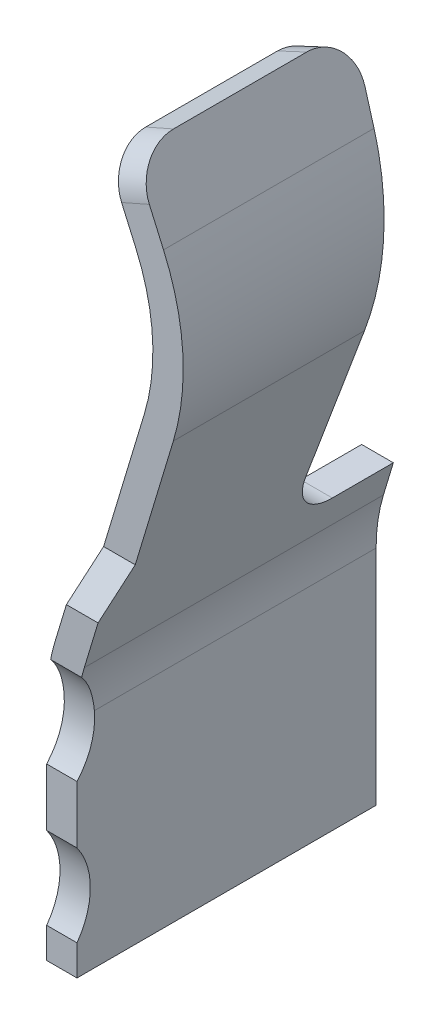
ISO-10303-21;
HEADER;
FILE_DESCRIPTION(('STEP AP214'),'2;1');
FILE_NAME('part.step','',(''),(''),'','','');
FILE_SCHEMA(('AUTOMOTIVE_DESIGN { 1 0 10303 214 1 1 1 1 }'));
ENDSEC;
DATA;
#1=APPLICATION_CONTEXT('core data for automotive mechanical design processes');
#2=APPLICATION_PROTOCOL_DEFINITION('international standard','automotive_design',2000,#1);
#3=PRODUCT_CONTEXT('',#1,'mechanical');
#4=PRODUCT('Part','Part','',(#3));
#5=PRODUCT_RELATED_PRODUCT_CATEGORY('part','',(#4));
#6=PRODUCT_DEFINITION_FORMATION('','',#4);
#7=PRODUCT_DEFINITION_CONTEXT('part definition',#1,'design');
#8=PRODUCT_DEFINITION('design','',#6,#7);
#9=PRODUCT_DEFINITION_SHAPE('','',#8);
#10=(LENGTH_UNIT() NAMED_UNIT(*) SI_UNIT(.MILLI.,.METRE.));
#11=(NAMED_UNIT(*) PLANE_ANGLE_UNIT() SI_UNIT($,.RADIAN.));
#12=(NAMED_UNIT(*) SI_UNIT($,.STERADIAN.) SOLID_ANGLE_UNIT());
#13=UNCERTAINTY_MEASURE_WITH_UNIT(LENGTH_MEASURE(1.E-05),#10,'distance_accuracy_value','');
#14=(GEOMETRIC_REPRESENTATION_CONTEXT(3) GLOBAL_UNCERTAINTY_ASSIGNED_CONTEXT((#13)) GLOBAL_UNIT_ASSIGNED_CONTEXT((#10,
#11,#12)) REPRESENTATION_CONTEXT('',''));
#15=CARTESIAN_POINT('',(0.,0.,0.));
#16=DIRECTION('',(0.,0.,1.));
#17=DIRECTION('',(1.,0.,0.));
#18=AXIS2_PLACEMENT_3D('',#15,#16,#17);
#19=CARTESIAN_POINT('',(13.38386274133,3.53312166947706,-0.236832722369338));
#20=DIRECTION('',(-0.914255270392897,-0.402239697454475,0.0483789866630426));
#21=DIRECTION('',(0.402711251685505,-0.915327071470026,0.));
#22=AXIS2_PLACEMENT_3D('',#19,#20,#21);
#23=CYLINDRICAL_SURFACE('',#22,0.2);
#24=CARTESIAN_POINT('',(13.3703585226747,3.50329761180303,-0.434687053017797));
#25=CARTESIAN_POINT('',(13.3192815955282,3.6193909515076,-0.448650066039084));
#26=CARTESIAN_POINT('',(13.2810128164818,3.70637250294574,-0.363398989614743));
#27=CARTESIAN_POINT('',(13.2810128164818,3.70637250294574,-0.235652283248446));
#28=(BOUNDED_CURVE() B_SPLINE_CURVE(3,(#24,#25,#26,#27),.UNSPECIFIED.,.F.,
.F.) B_SPLINE_CURVE_WITH_KNOTS((4,4),(3.0320715031167,4.71238898038462),
.UNSPECIFIED.) CURVE() GEOMETRIC_REPRESENTATION_ITEM() RATIONAL_B_SPLINE_CURVE((1.,
0.778229742533871,0.778229742533871,1.)) REPRESENTATION_ITEM(''));
#29=CARTESIAN_POINT('',(13.3703585226747,3.50329761180303,-0.434687053017797));
#30=VERTEX_POINT('',#29);
#31=CARTESIAN_POINT('',(13.2810128164818,3.70637250294574,-0.235652283248446));
#32=VERTEX_POINT('',#31);
#33=EDGE_CURVE('E329',#30,#32,#28,.T.);
#34=ORIENTED_EDGE('',*,*,#33,.F.);
#35=DIRECTION('',(0.914255270392898,0.402239697454473,-0.0483789866630426));
#36=VECTOR('',#35,1.);
#37=CARTESIAN_POINT('',(-10.677177596038,-7.07676024092296,0.837819069551529));
#38=LINE('',#37,#36);
#39=CARTESIAN_POINT('',(13.2330594619542,3.44289092405021,-0.427421697659669));
#40=VERTEX_POINT('',#39);
#41=EDGE_CURVE('E11',#40,#30,#38,.T.);
#42=ORIENTED_EDGE('',*,*,#41,.F.);
#43=CARTESIAN_POINT('',(13.1437137557613,3.64596581519291,-0.228386927890318));
#44=CARTESIAN_POINT('',(13.1437137557613,3.64596581519291,-0.356133634256616));
#45=CARTESIAN_POINT('',(13.1819825348076,3.55898426375477,-0.441384710680957));
#46=CARTESIAN_POINT('',(13.2330594619542,3.44289092405021,-0.427421697659669));
#47=(BOUNDED_CURVE() B_SPLINE_CURVE(3,(#43,#44,#45,#46),.UNSPECIFIED.,.F.,
.F.) B_SPLINE_CURVE_WITH_KNOTS((4,4),(1.57079632679495,3.25111380406287),
.UNSPECIFIED.) CURVE() GEOMETRIC_REPRESENTATION_ITEM() RATIONAL_B_SPLINE_CURVE((1.,
0.778229742533869,0.778229742533869,1.)) REPRESENTATION_ITEM(''));
#48=CARTESIAN_POINT('',(13.1437137557613,3.64596581519291,-0.228386927890318));
#49=VERTEX_POINT('',#48);
#50=EDGE_CURVE('E266',#49,#40,#47,.T.);
#51=ORIENTED_EDGE('',*,*,#50,.F.);
#52=DIRECTION('',(-0.914255270392898,-0.402239697454473,0.0483789866630426));
#53=VECTOR('',#52,1.);
#54=CARTESIAN_POINT('',(13.3033204909929,3.71618708377106,-0.236832722369339));
#55=LINE('',#54,#53);
#56=EDGE_CURVE('E259',#32,#49,#55,.T.);
#57=ORIENTED_EDGE('',*,*,#56,.F.);
#58=EDGE_LOOP('',(#34,#42,#51,#57));
#59=FACE_BOUND('',#58,.T.);
#60=ADVANCED_FACE('F16',(#59),#23,.T.);
#61=CARTESIAN_POINT('',(13.3615550668189,3.52330708865174,0.423604352914838));
#62=DIRECTION('',(0.915327071470026,0.402711251685505,0.));
#63=DIRECTION('',(-0.402711251685505,0.915327071470026,0.));
#64=AXIS2_PLACEMENT_3D('',#61,#62,#63);
#65=CYLINDRICAL_SURFACE('',#64,0.2);
#66=CARTESIAN_POINT('',(13.2242560060984,3.46290040089891,0.423604352914837));
#67=DIRECTION('',(-0.915327071470029,-0.402711251685498,0.));
#68=DIRECTION('',(-0.402711251685498,0.915327071470029,0.));
#69=AXIS2_PLACEMENT_3D('',#66,#67,#68);
#70=CIRCLE('',#69,0.2);
#71=CARTESIAN_POINT('',(13.2242560060984,3.46290040089891,0.623604352914837));
#72=VERTEX_POINT('',#71);
#73=CARTESIAN_POINT('',(13.1437137557613,3.64596581519291,0.423604352914837));
#74=VERTEX_POINT('',#73);
#75=EDGE_CURVE('E258',#72,#74,#70,.T.);
#76=ORIENTED_EDGE('',*,*,#75,.F.);
#77=DIRECTION('',(-0.915327071470027,-0.402711251685503,0.));
#78=VECTOR('',#77,1.);
#79=CARTESIAN_POINT('',(-11.3930633966531,-7.36784176638169,0.623604352914803));
#80=LINE('',#79,#78);
#81=CARTESIAN_POINT('',(13.3615550668189,3.52330708865174,0.623604352914837));
#82=VERTEX_POINT('',#81);
#83=EDGE_CURVE('E27',#82,#72,#80,.T.);
#84=ORIENTED_EDGE('',*,*,#83,.F.);
#85=CARTESIAN_POINT('',(13.3615550668189,3.52330708865174,0.423604352914838));
#86=DIRECTION('',(0.915327071470029,0.402711251685498,0.));
#87=DIRECTION('',(0.402711251685498,-0.915327071470029,0.));
#88=AXIS2_PLACEMENT_3D('',#85,#86,#87);
#89=CIRCLE('',#88,0.2);
#90=CARTESIAN_POINT('',(13.2810128164818,3.70637250294574,0.423604352914837));
#91=VERTEX_POINT('',#90);
#92=EDGE_CURVE('E319',#91,#82,#89,.T.);
#93=ORIENTED_EDGE('',*,*,#92,.F.);
#94=DIRECTION('',(0.915327071470027,0.402711251685503,0.));
#95=VECTOR('',#94,1.);
#96=CARTESIAN_POINT('',(13.2810128164818,3.70637250294574,0.423604352914837));
#97=LINE('',#96,#95);
#98=EDGE_CURVE('E270',#74,#91,#97,.T.);
#99=ORIENTED_EDGE('',*,*,#98,.F.);
#100=EDGE_LOOP('',(#76,#84,#93,#99));
#101=FACE_BOUND('',#100,.T.);
#102=ADVANCED_FACE('F543',(#101),#65,.T.);
#103=CARTESIAN_POINT('',(-15.49,1.65634067151207,-0.212546111318104));
#104=DIRECTION('',(0.,-1.,0.));
#105=DIRECTION('',(0.,0.,-1.));
#106=AXIS2_PLACEMENT_3D('',#103,#104,#105);
#107=PLANE('',#106);
#108=DIRECTION('',(0.,0.,-1.));
#109=VECTOR('',#108,1.);
#110=CARTESIAN_POINT('',(13.0484965908944,1.65634067151207,-0.740000000000021));
#111=LINE('',#110,#109);
#112=CARTESIAN_POINT('',(13.0484965908944,1.65634067151207,-0.438042305987955));
#113=VERTEX_POINT('',#112);
#114=CARTESIAN_POINT('',(13.0484965908944,1.65634067151207,-0.740000000000021));
#115=VERTEX_POINT('',#114);
#116=EDGE_CURVE('E401',#113,#115,#111,.T.);
#117=ORIENTED_EDGE('',*,*,#116,.F.);
#118=DIRECTION('',(1.,0.,0.));
#119=VECTOR('',#118,1.);
#120=CARTESIAN_POINT('',(13.2051649210584,1.65634067151207,-0.438042305987954));
#121=LINE('',#120,#119);
#122=CARTESIAN_POINT('',(13.2051649210585,1.65634067151207,-0.438042305987954));
#123=VERTEX_POINT('',#122);
#124=EDGE_CURVE('E359',#113,#123,#121,.T.);
#125=ORIENTED_EDGE('',*,*,#124,.T.);
#126=DIRECTION('',(0.,0.,1.));
#127=VECTOR('',#126,1.);
#128=CARTESIAN_POINT('',(13.2051649210585,1.65634067151207,-0.74000000000002));
#129=LINE('',#128,#127);
#130=CARTESIAN_POINT('',(13.2051649210585,1.65634067151207,-0.74000000000002));
#131=VERTEX_POINT('',#130);
#132=EDGE_CURVE('E436',#131,#123,#129,.T.);
#133=ORIENTED_EDGE('',*,*,#132,.F.);
#134=DIRECTION('',(-1.,0.,0.));
#135=VECTOR('',#134,1.);
#136=CARTESIAN_POINT('',(13.97,1.65634067151207,-0.740000000000019));
#137=LINE('',#136,#135);
#138=EDGE_CURVE('E320',#131,#115,#137,.T.);
#139=ORIENTED_EDGE('',*,*,#138,.T.);
#140=EDGE_LOOP('',(#117,#125,#133,#139));
#141=FACE_BOUND('',#140,.T.);
#142=ADVANCED_FACE('F546',(#141),#107,.F.);
#143=CARTESIAN_POINT('',(-15.49,3.70637250294571,-0.459111687165995));
#144=DIRECTION('',(0.,0.119413416546905,0.992844618230162));
#145=DIRECTION('',(1.,0.,0.));
#146=AXIS2_PLACEMENT_3D('',#143,#144,#145);
#147=PLANE('',#146);
#148=DIRECTION('',(0.286748539926818,0.951150986717315,-0.11439875574724));
#149=VECTOR('',#148,1.);
#150=CARTESIAN_POINT('',(13.1741223648881,1.55337185451571,-0.200161637444148));
#151=LINE('',#150,#149);
#152=CARTESIAN_POINT('',(13.2726600227304,1.88022335482146,-0.239473382341922));
#153=VERTEX_POINT('',#152);
#154=CARTESIAN_POINT('',(13.4802017604538,2.56864369924933,-0.322272466749581));
#155=VERTEX_POINT('',#154);
#156=EDGE_CURVE('E439',#153,#155,#151,.T.);
#157=ORIENTED_EDGE('',*,*,#156,.F.);
#158=DIRECTION('',(-1.,0.,0.));
#159=VECTOR('',#158,1.);
#160=CARTESIAN_POINT('',(13.0484965908944,1.88022335482146,-0.239473382341922));
#161=LINE('',#160,#159);
#162=CARTESIAN_POINT('',(13.1159916925664,1.88022335482146,-0.239473382341922));
#163=VERTEX_POINT('',#162);
#164=EDGE_CURVE('E441',#153,#163,#161,.T.);
#165=ORIENTED_EDGE('',*,*,#164,.T.);
#166=DIRECTION('',(-0.28674853992682,-0.951150986717314,0.11439875574724));
#167=VECTOR('',#166,1.);
#168=CARTESIAN_POINT('',(13.0303360451115,1.59610175610151,-0.205300934614505));
#169=LINE('',#168,#167);
#170=CARTESIAN_POINT('',(13.3365862640963,2.61194022573825,-0.327479914176623));
#171=VERTEX_POINT('',#170);
#172=EDGE_CURVE('E242',#171,#163,#169,.T.);
#173=ORIENTED_EDGE('',*,*,#172,.F.);
#174=CARTESIAN_POINT('',(13.2944766931834,3.30329498734983,-0.410631932744419));
#175=CARTESIAN_POINT('',(13.3914549897076,3.08287189317973,-0.384120760424612));
#176=CARTESIAN_POINT('',(13.4060955111766,2.84250387207174,-0.355210731501567));
#177=CARTESIAN_POINT('',(13.3365862640963,2.61194022573825,-0.327479914176623));
#178=(BOUNDED_CURVE() B_SPLINE_CURVE(3,(#174,#175,#176,#177),.UNSPECIFIED.,.F.,
.F.) B_SPLINE_CURVE_WITH_KNOTS((4,4),(4.29791199977039,5.00519872138853),
.UNSPECIFIED.) CURVE() GEOMETRIC_REPRESENTATION_ITEM() RATIONAL_B_SPLINE_CURVE((1.,
0.958744787021091,0.958744787021091,1.)) REPRESENTATION_ITEM(''));
#179=CARTESIAN_POINT('',(13.2944766931834,3.30329498734983,-0.410631932744419));
#180=VERTEX_POINT('',#179);
#181=EDGE_CURVE('E252',#180,#171,#178,.T.);
#182=ORIENTED_EDGE('',*,*,#181,.F.);
#183=DIRECTION('',(0.400292818236851,-0.909830186054405,0.109428936813833));
#184=VECTOR('',#183,1.);
#185=CARTESIAN_POINT('',(13.2800491803441,3.33608744850051,-0.414576013974334));
#186=LINE('',#185,#184);
#187=EDGE_CURVE('E250',#40,#180,#186,.T.);
#188=ORIENTED_EDGE('',*,*,#187,.F.);
#189=ORIENTED_EDGE('',*,*,#41,.T.);
#190=DIRECTION('',(-0.40029281823685,0.909830186054405,-0.109428936813833));
#191=VECTOR('',#190,1.);
#192=CARTESIAN_POINT('',(13.4176664899118,3.39577078475993,-0.421754368938235));
#193=LINE('',#192,#191);
#194=CARTESIAN_POINT('',(13.4317757539039,3.36370167510267,-0.417897288102547));
#195=VERTEX_POINT('',#194);
#196=EDGE_CURVE('E274',#195,#30,#193,.T.);
#197=ORIENTED_EDGE('',*,*,#196,.F.);
#198=CARTESIAN_POINT('',(13.4802017604538,2.56864369924933,-0.322272466749581));
#199=CARTESIAN_POINT('',(13.560137394596,2.83379189253285,-0.354162906673267));
#200=CARTESIAN_POINT('',(13.5433007949067,3.11021511680704,-0.387409439934769));
#201=CARTESIAN_POINT('',(13.4317757539039,3.36370167510267,-0.417897288102547));
#202=(BOUNDED_CURVE() B_SPLINE_CURVE(3,(#198,#199,#200,#201),.UNSPECIFIED.,.F.,
.F.) B_SPLINE_CURVE_WITH_KNOTS((4,4),(1.27798658579106,1.98527330740919),
.UNSPECIFIED.) CURVE() GEOMETRIC_REPRESENTATION_ITEM() RATIONAL_B_SPLINE_CURVE((1.,
0.958744787021091,0.958744787021091,1.)) REPRESENTATION_ITEM(''));
#203=EDGE_CURVE('E287',#155,#195,#202,.T.);
#204=ORIENTED_EDGE('',*,*,#203,.F.);
#205=EDGE_LOOP('',(#157,#165,#173,#182,#188,#189,#197,#204));
#206=FACE_BOUND('',#205,.T.);
#207=ADVANCED_FACE('F516',(#206),#147,.F.);
#208=CARTESIAN_POINT('',(-15.49,1.94413292378283,0.623604352914797));
#209=DIRECTION('',(0.,0.,-1.));
#210=DIRECTION('',(0.,-1.,0.));
#211=AXIS2_PLACEMENT_3D('',#208,#209,#210);
#212=PLANE('',#211);
#213=DIRECTION('',(0.4027112516855,-0.915327071470028,0.));
#214=VECTOR('',#213,1.);
#215=CARTESIAN_POINT('',(13.4317757539039,3.36370167510267,0.623604352914838));
#216=LINE('',#215,#214);
#217=CARTESIAN_POINT('',(13.4317757539039,3.36370167510267,0.623604352914838));
#218=VERTEX_POINT('',#217);
#219=EDGE_CURVE('E365',#82,#218,#216,.T.);
#220=ORIENTED_EDGE('',*,*,#219,.F.);
#221=ORIENTED_EDGE('',*,*,#83,.T.);
#222=DIRECTION('',(-0.402711251685501,0.915327071470028,0.));
#223=VECTOR('',#222,1.);
#224=CARTESIAN_POINT('',(13.2944766931834,3.30329498734984,0.623604352914837));
#225=LINE('',#224,#223);
#226=CARTESIAN_POINT('',(13.2944766931834,3.30329498734983,0.623604352914837));
#227=VERTEX_POINT('',#226);
#228=EDGE_CURVE('E247',#227,#72,#225,.T.);
#229=ORIENTED_EDGE('',*,*,#228,.F.);
#230=CARTESIAN_POINT('',(12.3791496217134,2.90058373566433,0.623604352914836));
#231=DIRECTION('',(0.,0.,1.));
#232=DIRECTION('',(-1.,0.,0.));
#233=AXIS2_PLACEMENT_3D('',#230,#231,#232);
#234=CIRCLE('',#233,1.);
#235=CARTESIAN_POINT('',(13.3365862640963,2.61194022573825,0.623604352914837));
#236=VERTEX_POINT('',#235);
#237=EDGE_CURVE('E230',#236,#227,#234,.T.);
#238=ORIENTED_EDGE('',*,*,#237,.F.);
#239=DIRECTION('',(0.28864350992609,0.957436642382956,0.));
#240=VECTOR('',#239,1.);
#241=CARTESIAN_POINT('',(13.012563357617,1.53714937485737,0.623604352914836));
#242=LINE('',#241,#240);
#243=CARTESIAN_POINT('',(13.1352588497716,1.94413292378283,0.623604352914837));
#244=VERTEX_POINT('',#243);
#245=EDGE_CURVE('E368',#244,#236,#242,.T.);
#246=ORIENTED_EDGE('',*,*,#245,.F.);
#247=DIRECTION('',(1.,0.,0.));
#248=VECTOR('',#247,1.);
#249=CARTESIAN_POINT('',(-15.49,1.94413292378283,0.623604352914797));
#250=LINE('',#249,#248);
#251=CARTESIAN_POINT('',(13.2919271799357,1.94413292378283,0.623604352914837));
#252=VERTEX_POINT('',#251);
#253=EDGE_CURVE('E323',#244,#252,#250,.T.);
#254=ORIENTED_EDGE('',*,*,#253,.T.);
#255=DIRECTION('',(-0.288643509926088,-0.957436642382956,0.));
#256=VECTOR('',#255,1.);
#257=CARTESIAN_POINT('',(13.1561788539745,1.49385284836845,0.623604352914837));
#258=LINE('',#257,#256);
#259=CARTESIAN_POINT('',(13.4802017604538,2.56864369924933,0.623604352914837));
#260=VERTEX_POINT('',#259);
#261=EDGE_CURVE('E341',#260,#252,#258,.T.);
#262=ORIENTED_EDGE('',*,*,#261,.F.);
#263=CARTESIAN_POINT('',(12.3791496217134,2.90058373566433,0.623604352914836));
#264=DIRECTION('',(0.,0.,-1.));
#265=DIRECTION('',(-1.,0.,0.));
#266=AXIS2_PLACEMENT_3D('',#263,#264,#265);
#267=CIRCLE('',#266,1.15);
#268=EDGE_CURVE('E286',#218,#260,#267,.T.);
#269=ORIENTED_EDGE('',*,*,#268,.F.);
#270=EDGE_LOOP('',(#220,#221,#229,#238,#246,#254,#262,#269));
#271=FACE_BOUND('',#270,.T.);
#272=ADVANCED_FACE('F255',(#271),#212,.F.);
#273=CARTESIAN_POINT('',(-15.49,1.7003498353216,0.749999999999972));
#274=DIRECTION('',(0.,-0.460287319631494,-0.887770005906065));
#275=DIRECTION('',(0.,-0.887770005906065,0.460287319631494));
#276=AXIS2_PLACEMENT_3D('',#273,#274,#275);
#277=PLANE('',#276);
#278=ORIENTED_EDGE('',*,*,#253,.F.);
#279=DIRECTION('',(0.258541028225373,0.857586072334425,-0.444637678635293));
#280=VECTOR('',#279,1.);
#281=CARTESIAN_POINT('',(13.1935765616936,2.13757401070795,0.523309818502746));
#282=LINE('',#281,#280);
#283=CARTESIAN_POINT('',(13.0675789123207,1.7196371362757,0.73999999999998));
#284=VERTEX_POINT('',#283);
#285=EDGE_CURVE('E297',#284,#244,#282,.T.);
#286=ORIENTED_EDGE('',*,*,#285,.F.);
#287=DIRECTION('',(-1.,0.,0.));
#288=VECTOR('',#287,1.);
#289=CARTESIAN_POINT('',(13.97,1.7196371362757,0.739999999999981));
#290=LINE('',#289,#288);
#291=CARTESIAN_POINT('',(13.2242472424848,1.7196371362757,0.73999999999998));
#292=VERTEX_POINT('',#291);
#293=EDGE_CURVE('E412',#292,#284,#290,.T.);
#294=ORIENTED_EDGE('',*,*,#293,.F.);
#295=DIRECTION('',(-0.258541028225372,-0.857586072334425,0.444637678635293));
#296=VECTOR('',#295,1.);
#297=CARTESIAN_POINT('',(13.3397726380838,2.10283732290249,0.541319952677682));
#298=LINE('',#297,#296);
#299=EDGE_CURVE('E345',#252,#292,#298,.T.);
#300=ORIENTED_EDGE('',*,*,#299,.F.);
#301=EDGE_LOOP('',(#278,#286,#294,#300));
#302=FACE_BOUND('',#301,.T.);
#303=ADVANCED_FACE('F491',(#302),#277,.F.);
#304=CARTESIAN_POINT('',(13.97,1.24850586493128,0.739999999999981));
#305=DIRECTION('',(0.,0.,-1.));
#306=DIRECTION('',(0.,-1.,0.));
#307=AXIS2_PLACEMENT_3D('',#304,#305,#306);
#308=PLANE('',#307);
#309=DIRECTION('',(0.,1.,0.));
#310=VECTOR('',#309,1.);
#311=CARTESIAN_POINT('',(13.12,0.145965815192914,0.73999999999998));
#312=LINE('',#311,#310);
#313=CARTESIAN_POINT('',(13.12,0.145965815192914,0.73999999999998));
#314=VERTEX_POINT('',#313);
#315=CARTESIAN_POINT('',(13.12,0.296740599868486,0.73999999999998));
#316=VERTEX_POINT('',#315);
#317=EDGE_CURVE('E358',#314,#316,#312,.T.);
#318=ORIENTED_EDGE('',*,*,#317,.T.);
#319=DIRECTION('',(-1.,0.,0.));
#320=VECTOR('',#319,1.);
#321=CARTESIAN_POINT('',(-15.49,0.296740599868486,0.73999999999994));
#322=LINE('',#321,#320);
#323=CARTESIAN_POINT('',(12.97,0.296740599868486,0.739999999999979));
#324=VERTEX_POINT('',#323);
#325=EDGE_CURVE('E304',#316,#324,#322,.T.);
#326=ORIENTED_EDGE('',*,*,#325,.T.);
#327=DIRECTION('',(0.,-1.,0.));
#328=VECTOR('',#327,1.);
#329=CARTESIAN_POINT('',(12.97,0.145965815192914,0.739999999999979));
#330=LINE('',#329,#328);
#331=CARTESIAN_POINT('',(12.97,0.145965815192914,0.739999999999979));
#332=VERTEX_POINT('',#331);
#333=EDGE_CURVE('E324',#324,#332,#330,.T.);
#334=ORIENTED_EDGE('',*,*,#333,.T.);
#335=DIRECTION('',(1.,0.,0.));
#336=VECTOR('',#335,1.);
#337=CARTESIAN_POINT('',(13.12,0.145965815192914,0.73999999999998));
#338=LINE('',#337,#336);
#339=EDGE_CURVE('E281',#332,#314,#338,.T.);
#340=ORIENTED_EDGE('',*,*,#339,.T.);
#341=EDGE_LOOP('',(#318,#326,#334,#340));
#342=FACE_BOUND('',#341,.T.);
#343=ADVANCED_FACE('F488',(#342),#308,.F.);
#344=CARTESIAN_POINT('',(13.97,1.24850586493128,-0.740000000000019));
#345=DIRECTION('',(0.,0.,-1.));
#346=DIRECTION('',(0.,-1.,0.));
#347=AXIS2_PLACEMENT_3D('',#344,#345,#346);
#348=PLANE('',#347);
#349=ORIENTED_EDGE('',*,*,#138,.F.);
#350=DIRECTION('',(0.288643509926088,0.957436642382956,0.));
#351=VECTOR('',#350,1.);
#352=CARTESIAN_POINT('',(13.1561788539745,1.49385284836845,-0.74000000000002));
#353=LINE('',#352,#351);
#354=CARTESIAN_POINT('',(13.1561788539745,1.49385284836845,-0.74000000000002));
#355=VERTEX_POINT('',#354);
#356=EDGE_CURVE('E440',#355,#131,#353,.T.);
#357=ORIENTED_EDGE('',*,*,#356,.F.);
#358=CARTESIAN_POINT('',(13.97,1.24850586493128,-0.740000000000019));
#359=DIRECTION('',(0.,0.,-1.));
#360=DIRECTION('',(1.,0.,0.));
#361=AXIS2_PLACEMENT_3D('',#358,#359,#360);
#362=CIRCLE('',#361,0.85);
#363=CARTESIAN_POINT('',(13.12,1.24850586493128,-0.74000000000002));
#364=VERTEX_POINT('',#363);
#365=EDGE_CURVE('E357',#364,#355,#362,.T.);
#366=ORIENTED_EDGE('',*,*,#365,.F.);
#367=DIRECTION('',(0.,1.,0.));
#368=VECTOR('',#367,1.);
#369=CARTESIAN_POINT('',(13.12,0.145965815192914,-0.74000000000002));
#370=LINE('',#369,#368);
#371=CARTESIAN_POINT('',(13.12,0.145965815192914,-0.74000000000002));
#372=VERTEX_POINT('',#371);
#373=EDGE_CURVE('E353',#372,#364,#370,.T.);
#374=ORIENTED_EDGE('',*,*,#373,.F.);
#375=DIRECTION('',(1.,0.,0.));
#376=VECTOR('',#375,1.);
#377=CARTESIAN_POINT('',(13.12,0.145965815192914,-0.74000000000002));
#378=LINE('',#377,#376);
#379=CARTESIAN_POINT('',(12.97,0.145965815192914,-0.740000000000021));
#380=VERTEX_POINT('',#379);
#381=EDGE_CURVE('E280',#380,#372,#378,.T.);
#382=ORIENTED_EDGE('',*,*,#381,.F.);
#383=DIRECTION('',(0.,-1.,0.));
#384=VECTOR('',#383,1.);
#385=CARTESIAN_POINT('',(12.97,0.145965815192914,-0.740000000000021));
#386=LINE('',#385,#384);
#387=CARTESIAN_POINT('',(12.97,1.24850586493128,-0.740000000000021));
#388=VERTEX_POINT('',#387);
#389=EDGE_CURVE('E42',#388,#380,#386,.T.);
#390=ORIENTED_EDGE('',*,*,#389,.F.);
#391=CARTESIAN_POINT('',(13.97,1.24850586493128,-0.740000000000019));
#392=DIRECTION('',(0.,0.,1.));
#393=DIRECTION('',(1.,0.,0.));
#394=AXIS2_PLACEMENT_3D('',#391,#392,#393);
#395=CIRCLE('',#394,1.);
#396=CARTESIAN_POINT('',(13.012563357617,1.53714937485737,-0.740000000000021));
#397=VERTEX_POINT('',#396);
#398=EDGE_CURVE('E309',#397,#388,#395,.T.);
#399=ORIENTED_EDGE('',*,*,#398,.F.);
#400=DIRECTION('',(-0.28864350992609,-0.957436642382956,0.));
#401=VECTOR('',#400,1.);
#402=CARTESIAN_POINT('',(13.012563357617,1.53714937485737,-0.740000000000021));
#403=LINE('',#402,#401);
#404=EDGE_CURVE('E298',#115,#397,#403,.T.);
#405=ORIENTED_EDGE('',*,*,#404,.F.);
#406=EDGE_LOOP('',(#349,#357,#366,#374,#382,#390,#399,#405));
#407=FACE_BOUND('',#406,.T.);
#408=ADVANCED_FACE('F18',(#407),#348,.T.);
#409=CARTESIAN_POINT('',(12.97,0.145965815192914,-0.740000000000021));
#410=DIRECTION('',(1.,0.,0.));
#411=DIRECTION('',(0.,1.,0.));
#412=AXIS2_PLACEMENT_3D('',#409,#410,#411);
#413=PLANE('',#412);
#414=DIRECTION('',(0.,-1.,0.));
#415=VECTOR('',#414,1.);
#416=CARTESIAN_POINT('',(12.97,0.145965815192914,0.739999999999979));
#417=LINE('',#416,#415);
#418=CARTESIAN_POINT('',(12.97,0.988055123608201,0.739999999999979));
#419=VERTEX_POINT('',#418);
#420=CARTESIAN_POINT('',(12.97,0.703259400131467,0.739999999999979));
#421=VERTEX_POINT('',#420);
#422=EDGE_CURVE('E291',#419,#421,#417,.T.);
#423=ORIENTED_EDGE('',*,*,#422,.F.);
#424=CARTESIAN_POINT('',(12.97,1.21669179396546,0.995153761033096));
#425=DIRECTION('',(1.,0.,0.));
#426=DIRECTION('',(0.,1.,0.));
#427=AXIS2_PLACEMENT_3D('',#424,#425,#426);
#428=CIRCLE('',#427,0.342604974863759);
#429=CARTESIAN_POINT('',(12.97,1.24850586493128,0.654029100989324));
#430=VERTEX_POINT('',#429);
#431=EDGE_CURVE('E445',#419,#430,#428,.T.);
#432=ORIENTED_EDGE('',*,*,#431,.T.);
#433=DIRECTION('',(0.,0.,1.));
#434=VECTOR('',#433,1.);
#435=CARTESIAN_POINT('',(12.97,1.24850586493128,-0.740000000000021));
#436=LINE('',#435,#434);
#437=EDGE_CURVE('E312',#388,#430,#436,.T.);
#438=ORIENTED_EDGE('',*,*,#437,.F.);
#439=ORIENTED_EDGE('',*,*,#389,.T.);
#440=DIRECTION('',(0.,0.,1.));
#441=VECTOR('',#440,1.);
#442=CARTESIAN_POINT('',(12.97,0.145965815192914,-0.740000000000021));
#443=LINE('',#442,#441);
#444=EDGE_CURVE('E276',#380,#332,#443,.T.);
#445=ORIENTED_EDGE('',*,*,#444,.T.);
#446=ORIENTED_EDGE('',*,*,#333,.F.);
#447=CARTESIAN_POINT('',(12.97,0.499999999999977,1.0194268345702));
#448=DIRECTION('',(1.,0.,0.));
#449=DIRECTION('',(0.,1.,0.));
#450=AXIS2_PLACEMENT_3D('',#447,#448,#449);
#451=CIRCLE('',#450,0.345533991988848);
#452=EDGE_CURVE('E390',#324,#421,#451,.T.);
#453=ORIENTED_EDGE('',*,*,#452,.T.);
#454=EDGE_LOOP('',(#423,#432,#438,#439,#445,#446,#453));
#455=FACE_BOUND('',#454,.T.);
#456=ADVANCED_FACE('F486',(#455),#413,.F.);
#457=CARTESIAN_POINT('',(13.97,1.24850586493128,-0.740000000000019));
#458=DIRECTION('',(0.,0.,1.));
#459=DIRECTION('',(-1.,0.,0.));
#460=AXIS2_PLACEMENT_3D('',#457,#458,#459);
#461=CYLINDRICAL_SURFACE('',#460,1.);
#462=ORIENTED_EDGE('',*,*,#437,.T.);
#463=CARTESIAN_POINT('',(12.97,1.24850586493127,0.654029100989324));
#464=CARTESIAN_POINT('',(12.9699999259264,1.25306932177748,0.654454497923835));
#465=CARTESIAN_POINT('',(12.9700312352786,1.25762446546712,0.654969794425774));
#466=CARTESIAN_POINT('',(12.9701551650957,1.26669234380872,0.656178662703507));
#467=CARTESIAN_POINT('',(12.970247549203,1.27120517419842,0.656871540938563));
#468=CARTESIAN_POINT('',(12.9704919132932,1.28018764830056,0.658435530000101));
#469=CARTESIAN_POINT('',(12.9706437571039,1.28465736694881,0.659306231418194));
#470=CARTESIAN_POINT('',(12.971005222969,1.29355289226453,0.661225514697385));
#471=CARTESIAN_POINT('',(12.9712148055409,1.29797872680563,0.66227397481712));
#472=CARTESIAN_POINT('',(12.9716899720729,1.30678583476397,0.664548502475786));
#473=CARTESIAN_POINT('',(12.971955607474,1.31116706334694,0.665774732832754));
#474=CARTESIAN_POINT('',(12.9725411084712,1.31988437499395,0.668404514864849));
#475=CARTESIAN_POINT('',(12.9728611090054,1.32422031651338,0.669808505488944));
#476=CARTESIAN_POINT('',(12.9735535893038,1.33284654509273,0.672793524574298));
#477=CARTESIAN_POINT('',(12.9739262786269,1.33713657245114,0.67437525453736));
#478=CARTESIAN_POINT('',(12.9747223975815,1.34567049059148,0.677715533217567));
#479=CARTESIAN_POINT('',(12.975146101327,1.34991398511754,0.679475028174295));
#480=CARTESIAN_POINT('',(12.9760367815061,1.35830019523904,0.683146652073494));
#481=CARTESIAN_POINT('',(12.9765034928044,1.36244335249443,0.685057836907499));
#482=CARTESIAN_POINT('',(12.977476871398,1.37063194178074,0.6890335315101));
#483=CARTESIAN_POINT('',(12.9779833878834,1.3746776733665,0.691097460992356));
#484=CARTESIAN_POINT('',(12.9790328683176,1.38267128376232,0.695378434355305));
#485=CARTESIAN_POINT('',(12.9795757526474,1.3866193519919,0.69759514404689));
#486=CARTESIAN_POINT('',(12.9806945570178,1.39441764648526,0.702181418874191));
#487=CARTESIAN_POINT('',(12.9812704570056,1.39826793013232,0.704550891332612));
#488=CARTESIAN_POINT('',(12.982451970372,1.40587073759695,0.709442454924467));
#489=CARTESIAN_POINT('',(12.9830576108172,1.40962316741917,0.711964685588729));
#490=CARTESIAN_POINT('',(12.9842953792636,1.4170304504751,0.717161525963165));
#491=CARTESIAN_POINT('',(12.984927568527,1.42068504210779,0.719836493879691));
#492=CARTESIAN_POINT('',(12.9862152934578,1.42789683764576,0.725338623347788));
#493=CARTESIAN_POINT('',(12.9868709115292,1.43145359950846,0.728166344681211));
#494=CARTESIAN_POINT('',(12.9882024840542,1.43847023752972,0.733973670299352));
#495=CARTESIAN_POINT('',(12.988878529499,1.44192948379825,0.736954014976151));
#496=CARTESIAN_POINT('',(12.9895608818653,1.44532846432271,0.73999999999998));
#497=B_SPLINE_CURVE_WITH_KNOTS('',3,(#463,#464,#465,#466,#467,#468,#469,#470,#471,#472,#473,
#474,#475,#476,#477,#478,#479,#480,#481,#482,#483,#484,#485,#486,#487,#488,#489,#490,#491,#492,
#493,#494,#495,#496),.UNSPECIFIED.,.F.,.F.,(4,2,2,2,2,2,2,2,2,2,2,2,2,2,2,2,4),(0.,
0.013748827736232,0.0274447569667543,0.0411095020469267,0.0547649260984996,0.0684329369744623,
0.0821353821572885,0.0958939450956066,0.109730045405059,0.123485924962941,0.137191991355335,
0.150868974599205,0.164537737053089,0.17821917870054,0.191934141578145,0.205703315519925,
0.219547147320743),.UNSPECIFIED.);
#498=CARTESIAN_POINT('',(12.9895608818653,1.44532846432271,0.739999999999979));
#499=VERTEX_POINT('',#498);
#500=EDGE_CURVE('E394',#430,#499,#497,.T.);
#501=ORIENTED_EDGE('',*,*,#500,.T.);
#502=CARTESIAN_POINT('',(13.97,1.24850586493128,0.739999999999981));
#503=DIRECTION('',(0.,0.,1.));
#504=DIRECTION('',(1.,0.,0.));
#505=AXIS2_PLACEMENT_3D('',#502,#503,#504);
#506=CIRCLE('',#505,1.);
#507=CARTESIAN_POINT('',(13.012563357617,1.53714937485737,0.739999999999979));
#508=VERTEX_POINT('',#507);
#509=EDGE_CURVE('E583',#508,#499,#506,.T.);
#510=ORIENTED_EDGE('',*,*,#509,.F.);
#511=DIRECTION('',(0.,0.,1.));
#512=VECTOR('',#511,1.);
#513=CARTESIAN_POINT('',(13.012563357617,1.53714937485737,-0.740000000000021));
#514=LINE('',#513,#512);
#515=EDGE_CURVE('E294',#397,#508,#514,.T.);
#516=ORIENTED_EDGE('',*,*,#515,.F.);
#517=ORIENTED_EDGE('',*,*,#398,.T.);
#518=EDGE_LOOP('',(#462,#501,#510,#516,#517));
#519=FACE_BOUND('',#518,.T.);
#520=ADVANCED_FACE('F475',(#519),#461,.T.);
#521=CARTESIAN_POINT('',(13.012563357617,1.53714937485737,-0.740000000000021));
#522=DIRECTION('',(0.957436642382956,-0.28864350992609,0.));
#523=DIRECTION('',(0.,0.,-1.));
#524=AXIS2_PLACEMENT_3D('',#521,#522,#523);
#525=PLANE('',#524);
#526=ORIENTED_EDGE('',*,*,#172,.T.);
#527=CARTESIAN_POINT('',(13.1159916925664,1.88022335482146,-0.239473382341922));
#528=CARTESIAN_POINT('',(13.1136017257014,1.87229578405696,-0.238519901512672));
#529=CARTESIAN_POINT('',(13.1111988444155,1.86432537588468,-0.238042305987954));
#530=CARTESIAN_POINT('',(13.1087916531782,1.85634067151208,-0.238042305987954));
#531=(BOUNDED_CURVE() B_SPLINE_CURVE(3,(#527,#528,#529,#530),.UNSPECIFIED.,.F.,
.F.) B_SPLINE_CURVE_WITH_KNOTS((4,4),(4.59268992994791,4.71238898038469),
.UNSPECIFIED.) CURVE() GEOMETRIC_REPRESENTATION_ITEM() RATIONAL_B_SPLINE_CURVE((1.,
0.998806367803328,0.998806367803328,1.)) REPRESENTATION_ITEM(''));
#532=CARTESIAN_POINT('',(13.1087916531782,1.85634067151208,-0.238042305987954));
#533=VERTEX_POINT('',#532);
#534=EDGE_CURVE('E446',#163,#533,#531,.T.);
#535=ORIENTED_EDGE('',*,*,#534,.T.);
#536=CARTESIAN_POINT('',(13.1087916531782,1.85634067151208,-0.238042305987954));
#537=CARTESIAN_POINT('',(13.0734716234365,1.73918338398669,-0.238042305987954));
#538=CARTESIAN_POINT('',(13.0484965908944,1.65634067151208,-0.320885018462573));
#539=CARTESIAN_POINT('',(13.0484965908944,1.65634067151207,-0.438042305987955));
#540=(BOUNDED_CURVE() B_SPLINE_CURVE(3,(#536,#537,#538,#539),.UNSPECIFIED.,.F.,
.F.) B_SPLINE_CURVE_WITH_KNOTS((4,4),(4.71238898038469,6.28318530717959),
.UNSPECIFIED.) CURVE() GEOMETRIC_REPRESENTATION_ITEM() RATIONAL_B_SPLINE_CURVE((1.,
0.804737854124365,0.804737854124365,1.)) REPRESENTATION_ITEM(''));
#541=EDGE_CURVE('E363',#533,#113,#540,.T.);
#542=ORIENTED_EDGE('',*,*,#541,.T.);
#543=ORIENTED_EDGE('',*,*,#116,.T.);
#544=ORIENTED_EDGE('',*,*,#404,.T.);
#545=ORIENTED_EDGE('',*,*,#515,.T.);
#546=DIRECTION('',(-0.28864350992609,-0.957436642382956,0.));
#547=VECTOR('',#546,1.);
#548=CARTESIAN_POINT('',(13.012563357617,1.53714937485737,0.739999999999979));
#549=LINE('',#548,#547);
#550=EDGE_CURVE('E419',#284,#508,#549,.T.);
#551=ORIENTED_EDGE('',*,*,#550,.F.);
#552=ORIENTED_EDGE('',*,*,#285,.T.);
#553=ORIENTED_EDGE('',*,*,#245,.T.);
#554=DIRECTION('',(0.,0.,1.));
#555=VECTOR('',#554,1.);
#556=CARTESIAN_POINT('',(13.3365862640963,2.61194022573825,-0.74000000000002));
#557=LINE('',#556,#555);
#558=EDGE_CURVE('E237',#171,#236,#557,.T.);
#559=ORIENTED_EDGE('',*,*,#558,.F.);
#560=EDGE_LOOP('',(#526,#535,#542,#543,#544,#545,#551,#552,#553,#559));
#561=FACE_BOUND('',#560,.T.);
#562=ADVANCED_FACE('F485',(#561),#525,.F.);
#563=CARTESIAN_POINT('',(12.3791496217134,2.90058373566433,-0.740000000000021));
#564=DIRECTION('',(0.,0.,1.));
#565=DIRECTION('',(-1.,0.,0.));
#566=AXIS2_PLACEMENT_3D('',#563,#564,#565);
#567=CYLINDRICAL_SURFACE('',#566,1.);
#568=DIRECTION('',(0.,0.,1.));
#569=VECTOR('',#568,1.);
#570=CARTESIAN_POINT('',(13.2944766931834,3.30329498734983,-0.74000000000002));
#571=LINE('',#570,#569);
#572=EDGE_CURVE('E234',#180,#227,#571,.T.);
#573=ORIENTED_EDGE('',*,*,#572,.F.);
#574=ORIENTED_EDGE('',*,*,#181,.T.);
#575=ORIENTED_EDGE('',*,*,#558,.T.);
#576=ORIENTED_EDGE('',*,*,#237,.T.);
#577=EDGE_LOOP('',(#573,#574,#575,#576));
#578=FACE_BOUND('',#577,.T.);
#579=ADVANCED_FACE('F232',(#578),#567,.F.);
#580=CARTESIAN_POINT('',(13.2944766931834,3.30329498734984,-0.74000000000002));
#581=DIRECTION('',(0.915327071470028,0.402711251685501,0.));
#582=DIRECTION('',(0.,0.,-1.));
#583=AXIS2_PLACEMENT_3D('',#580,#581,#582);
#584=PLANE('',#583);
#585=ORIENTED_EDGE('',*,*,#228,.T.);
#586=ORIENTED_EDGE('',*,*,#75,.T.);
#587=DIRECTION('',(0.,0.,1.));
#588=VECTOR('',#587,1.);
#589=CARTESIAN_POINT('',(13.1437137557613,3.64596581519291,-0.740000000000021));
#590=LINE('',#589,#588);
#591=EDGE_CURVE('E335',#49,#74,#590,.T.);
#592=ORIENTED_EDGE('',*,*,#591,.F.);
#593=ORIENTED_EDGE('',*,*,#50,.T.);
#594=ORIENTED_EDGE('',*,*,#187,.T.);
#595=ORIENTED_EDGE('',*,*,#572,.T.);
#596=EDGE_LOOP('',(#585,#586,#592,#593,#594,#595));
#597=FACE_BOUND('',#596,.T.);
#598=ADVANCED_FACE('F246',(#597),#584,.F.);
#599=CARTESIAN_POINT('',(13.2810128164818,3.70637250294574,-0.74000000000002));
#600=DIRECTION('',(0.402711251685503,-0.915327071470027,0.));
#601=DIRECTION('',(0.,0.,-1.));
#602=AXIS2_PLACEMENT_3D('',#599,#600,#601);
#603=PLANE('',#602);
#604=ORIENTED_EDGE('',*,*,#591,.T.);
#605=ORIENTED_EDGE('',*,*,#98,.T.);
#606=DIRECTION('',(0.,0.,1.));
#607=VECTOR('',#606,1.);
#608=CARTESIAN_POINT('',(13.2810128164818,3.70637250294574,-0.74000000000002));
#609=LINE('',#608,#607);
#610=EDGE_CURVE('E315',#32,#91,#609,.T.);
#611=ORIENTED_EDGE('',*,*,#610,.F.);
#612=ORIENTED_EDGE('',*,*,#56,.T.);
#613=EDGE_LOOP('',(#604,#605,#611,#612));
#614=FACE_BOUND('',#613,.T.);
#615=ADVANCED_FACE('F525',(#614),#603,.F.);
#616=CARTESIAN_POINT('',(13.4317757539039,3.36370167510267,-0.74000000000002));
#617=DIRECTION('',(-0.915327071470028,-0.4027112516855,0.));
#618=DIRECTION('',(-0.4027112516855,0.915327071470028,0.));
#619=AXIS2_PLACEMENT_3D('',#616,#617,#618);
#620=PLANE('',#619);
#621=ORIENTED_EDGE('',*,*,#610,.T.);
#622=ORIENTED_EDGE('',*,*,#92,.T.);
#623=ORIENTED_EDGE('',*,*,#219,.T.);
#624=DIRECTION('',(0.,0.,1.));
#625=VECTOR('',#624,1.);
#626=CARTESIAN_POINT('',(13.4317757539039,3.36370167510267,-0.74000000000002));
#627=LINE('',#626,#625);
#628=EDGE_CURVE('E282',#195,#218,#627,.T.);
#629=ORIENTED_EDGE('',*,*,#628,.F.);
#630=ORIENTED_EDGE('',*,*,#196,.T.);
#631=ORIENTED_EDGE('',*,*,#33,.T.);
#632=EDGE_LOOP('',(#621,#622,#623,#629,#630,#631));
#633=FACE_BOUND('',#632,.T.);
#634=ADVANCED_FACE('F497',(#633),#620,.F.);
#635=CARTESIAN_POINT('',(12.3791496217134,2.90058373566433,-0.740000000000021));
#636=DIRECTION('',(0.,0.,1.));
#637=DIRECTION('',(-1.,0.,0.));
#638=AXIS2_PLACEMENT_3D('',#635,#636,#637);
#639=CYLINDRICAL_SURFACE('',#638,1.15);
#640=DIRECTION('',(0.,0.,1.));
#641=VECTOR('',#640,1.);
#642=CARTESIAN_POINT('',(13.4802017604538,2.56864369924933,-0.74000000000002));
#643=LINE('',#642,#641);
#644=EDGE_CURVE('E346',#155,#260,#643,.T.);
#645=ORIENTED_EDGE('',*,*,#644,.F.);
#646=ORIENTED_EDGE('',*,*,#203,.T.);
#647=ORIENTED_EDGE('',*,*,#628,.T.);
#648=ORIENTED_EDGE('',*,*,#268,.T.);
#649=EDGE_LOOP('',(#645,#646,#647,#648));
#650=FACE_BOUND('',#649,.T.);
#651=ADVANCED_FACE('F493',(#650),#639,.T.);
#652=CARTESIAN_POINT('',(13.1561788539745,1.49385284836845,-0.74000000000002));
#653=DIRECTION('',(-0.957436642382956,0.288643509926088,0.));
#654=DIRECTION('',(0.,0.,1.));
#655=AXIS2_PLACEMENT_3D('',#652,#653,#654);
#656=PLANE('',#655);
#657=ORIENTED_EDGE('',*,*,#356,.T.);
#658=ORIENTED_EDGE('',*,*,#132,.T.);
#659=CARTESIAN_POINT('',(13.2051649210585,1.65634067151207,-0.438042305987954));
#660=CARTESIAN_POINT('',(13.2051649210585,1.65634067151208,-0.320885018462573));
#661=CARTESIAN_POINT('',(13.2301399536005,1.73918338398669,-0.238042305987954));
#662=CARTESIAN_POINT('',(13.2654599833422,1.85634067151208,-0.238042305987954));
#663=(BOUNDED_CURVE() B_SPLINE_CURVE(3,(#659,#660,#661,#662),.UNSPECIFIED.,.F.,
.F.) B_SPLINE_CURVE_WITH_KNOTS((4,4),(0.,1.5707963267949),
.UNSPECIFIED.) CURVE() GEOMETRIC_REPRESENTATION_ITEM() RATIONAL_B_SPLINE_CURVE((1.,
0.804737854124365,0.804737854124365,1.)) REPRESENTATION_ITEM(''));
#664=CARTESIAN_POINT('',(13.2654599833422,1.85634067151208,-0.238042305987954));
#665=VERTEX_POINT('',#664);
#666=EDGE_CURVE('E364',#123,#665,#663,.T.);
#667=ORIENTED_EDGE('',*,*,#666,.T.);
#668=CARTESIAN_POINT('',(13.2654599833422,1.85634067151208,-0.238042305987954));
#669=CARTESIAN_POINT('',(13.2678671745795,1.86432537588468,-0.238042305987954));
#670=CARTESIAN_POINT('',(13.2702700558654,1.87229578405696,-0.238519901512672));
#671=CARTESIAN_POINT('',(13.2726600227304,1.88022335482146,-0.239473382341922));
#672=(BOUNDED_CURVE() B_SPLINE_CURVE(3,(#668,#669,#670,#671),.UNSPECIFIED.,.F.,
.F.) B_SPLINE_CURVE_WITH_KNOTS((4,4),(1.5707963267949,1.69049537723168),
.UNSPECIFIED.) CURVE() GEOMETRIC_REPRESENTATION_ITEM() RATIONAL_B_SPLINE_CURVE((1.,
0.998806367803328,0.998806367803328,1.)) REPRESENTATION_ITEM(''));
#673=EDGE_CURVE('E395',#665,#153,#672,.T.);
#674=ORIENTED_EDGE('',*,*,#673,.T.);
#675=ORIENTED_EDGE('',*,*,#156,.T.);
#676=ORIENTED_EDGE('',*,*,#644,.T.);
#677=ORIENTED_EDGE('',*,*,#261,.T.);
#678=ORIENTED_EDGE('',*,*,#299,.T.);
#679=DIRECTION('',(0.288643509926088,0.957436642382956,0.));
#680=VECTOR('',#679,1.);
#681=CARTESIAN_POINT('',(13.1561788539745,1.49385284836845,0.73999999999998));
#682=LINE('',#681,#680);
#683=CARTESIAN_POINT('',(13.1561788539745,1.49385284836845,0.73999999999998));
#684=VERTEX_POINT('',#683);
#685=EDGE_CURVE('E420',#684,#292,#682,.T.);
#686=ORIENTED_EDGE('',*,*,#685,.F.);
#687=DIRECTION('',(0.,0.,1.));
#688=VECTOR('',#687,1.);
#689=CARTESIAN_POINT('',(13.1561788539745,1.49385284836845,-0.74000000000002));
#690=LINE('',#689,#688);
#691=EDGE_CURVE('E423',#355,#684,#690,.T.);
#692=ORIENTED_EDGE('',*,*,#691,.F.);
#693=EDGE_LOOP('',(#657,#658,#667,#674,#675,#676,#677,#678,#686,#692));
#694=FACE_BOUND('',#693,.T.);
#695=ADVANCED_FACE('F496',(#694),#656,.F.);
#696=CARTESIAN_POINT('',(13.97,1.24850586493128,-0.740000000000019));
#697=DIRECTION('',(0.,0.,1.));
#698=DIRECTION('',(-1.,0.,0.));
#699=AXIS2_PLACEMENT_3D('',#696,#697,#698);
#700=CYLINDRICAL_SURFACE('',#699,0.85);
#701=CARTESIAN_POINT('',(13.97,1.24850586493128,0.739999999999981));
#702=DIRECTION('',(0.,0.,-1.));
#703=DIRECTION('',(1.,0.,0.));
#704=AXIS2_PLACEMENT_3D('',#701,#702,#703);
#705=CIRCLE('',#704,0.85);
#706=CARTESIAN_POINT('',(13.1431016601971,1.44532846432271,0.73999999999998));
#707=VERTEX_POINT('',#706);
#708=EDGE_CURVE('E328',#707,#684,#705,.T.);
#709=ORIENTED_EDGE('',*,*,#708,.F.);
#710=CARTESIAN_POINT('',(13.1431016601971,1.44532846432271,0.73999999999998));
#711=CARTESIAN_POINT('',(13.1422937359608,1.44193422770695,0.736958271493098));
#712=CARTESIAN_POINT('',(13.1414935308879,1.43847955797059,0.733981716742319));
#713=CARTESIAN_POINT('',(13.1399179745642,1.43147212175971,0.728181521053011));
#714=CARTESIAN_POINT('',(13.139142509545,1.42792001022663,0.725357119538411));
#715=CARTESIAN_POINT('',(13.137619898276,1.4207175323937,0.719861180213829));
#716=CARTESIAN_POINT('',(13.1368726475581,1.41706763678396,0.71718905488421));
#717=CARTESIAN_POINT('',(13.1354100533638,1.40966975247532,0.711997459324748));
#718=CARTESIAN_POINT('',(13.1346946289265,1.40592205633012,0.70947759512215));
#719=CARTESIAN_POINT('',(13.1332993425092,1.39832873431199,0.704590332990138));
#720=CARTESIAN_POINT('',(13.1326194379124,1.39448323442784,0.702222751523349));
#721=CARTESIAN_POINT('',(13.1312989275512,1.38669456373035,0.697639830714333));
#722=CARTESIAN_POINT('',(13.130658332248,1.38275136730644,0.695424531879018));
#723=CARTESIAN_POINT('',(13.1294202487445,1.37476761007239,0.691145978302787));
#724=CARTESIAN_POINT('',(13.1288228383314,1.37072689023599,0.689082997790646));
#725=CARTESIAN_POINT('',(13.1276750208946,1.36254855284234,0.685108739352284));
#726=CARTESIAN_POINT('',(13.1271247723653,1.35841066384869,0.683197974378515));
#727=CARTESIAN_POINT('',(13.1260735612992,1.35002514120476,0.679522568881539));
#728=CARTESIAN_POINT('',(13.1255730181972,1.34577690210598,0.677759189022487));
#729=CARTESIAN_POINT('',(13.1246327010762,1.33723291777967,0.674411725036891));
#730=CARTESIAN_POINT('',(13.1241925856845,1.33293760118074,0.672826643700267));
#731=CARTESIAN_POINT('',(13.1233749886142,1.32430048357208,0.669835440034503));
#732=CARTESIAN_POINT('',(13.1229972403523,1.31995896955667,0.668428562333123));
#733=CARTESIAN_POINT('',(13.1223062239364,1.31123044848471,0.665793545957981));
#734=CARTESIAN_POINT('',(13.1219927759782,1.3068436053387,0.664564911759195));
#735=CARTESIAN_POINT('',(13.1214322058704,1.29802547391543,0.662286113687467));
#736=CARTESIAN_POINT('',(13.1211850012893,1.29359424806089,0.661235728608814));
#737=CARTESIAN_POINT('',(13.1207587472366,1.28468842884806,0.65931313537944));
#738=CARTESIAN_POINT('',(13.1205797216278,1.28021382086674,0.658440989662554));
#739=CARTESIAN_POINT('',(13.1202916840783,1.27122235283852,0.656874652664155));
#740=CARTESIAN_POINT('',(13.1201828092591,1.26670542744488,0.656180811490092));
#741=CARTESIAN_POINT('',(13.1200367958811,1.25763046365139,0.654970556104551));
#742=CARTESIAN_POINT('',(13.1199999120407,1.25307233639069,0.654454777190054));
#743=CARTESIAN_POINT('',(13.12,1.24850586493127,0.654029100989324));
#744=B_SPLINE_CURVE_WITH_KNOTS('',3,(#710,#711,#712,#713,#714,#715,#716,#717,#718,#719,#720,
#721,#722,#723,#724,#725,#726,#727,#728,#729,#730,#731,#732,#733,#734,#735,#736,#737,#738,#739,
#740,#741,#742,#743),.UNSPECIFIED.,.F.,.F.,(4,2,2,2,2,2,2,2,2,2,2,2,2,2,2,2,4),(0.,
0.0138857173785059,0.0276939528951882,0.0414446944234779,0.0551581812157601,0.0688548176549652,
0.0825550833892895,0.0962794417966584,0.110048248811198,0.123924815747354,0.137719445398476,
0.151453492382398,0.165148594715206,0.178826575238555,0.192509338715511,0.206218766980375,
0.219976614634782),.UNSPECIFIED.);
#745=CARTESIAN_POINT('',(13.12,1.24850586493128,0.654029100989325));
#746=VERTEX_POINT('',#745);
#747=EDGE_CURVE('E592',#707,#746,#744,.T.);
#748=ORIENTED_EDGE('',*,*,#747,.T.);
#749=DIRECTION('',(0.,0.,1.));
#750=VECTOR('',#749,1.);
#751=CARTESIAN_POINT('',(13.12,1.24850586493128,-0.74000000000002));
#752=LINE('',#751,#750);
#753=EDGE_CURVE('E352',#364,#746,#752,.T.);
#754=ORIENTED_EDGE('',*,*,#753,.F.);
#755=ORIENTED_EDGE('',*,*,#365,.T.);
#756=ORIENTED_EDGE('',*,*,#691,.T.);
#757=EDGE_LOOP('',(#709,#748,#754,#755,#756));
#758=FACE_BOUND('',#757,.T.);
#759=ADVANCED_FACE('F503',(#758),#700,.F.);
#760=CARTESIAN_POINT('',(13.12,0.145965815192914,-0.74000000000002));
#761=DIRECTION('',(-1.,0.,0.));
#762=DIRECTION('',(0.,0.,1.));
#763=AXIS2_PLACEMENT_3D('',#760,#761,#762);
#764=PLANE('',#763);
#765=ORIENTED_EDGE('',*,*,#753,.T.);
#766=CARTESIAN_POINT('',(13.12,1.21669179396546,0.995153761033097));
#767=DIRECTION('',(-1.,0.,0.));
#768=DIRECTION('',(0.,0.,1.));
#769=AXIS2_PLACEMENT_3D('',#766,#767,#768);
#770=CIRCLE('',#769,0.342604974863759);
#771=CARTESIAN_POINT('',(13.12,0.988055123608201,0.73999999999998));
#772=VERTEX_POINT('',#771);
#773=EDGE_CURVE('E589',#746,#772,#770,.T.);
#774=ORIENTED_EDGE('',*,*,#773,.T.);
#775=DIRECTION('',(0.,1.,0.));
#776=VECTOR('',#775,1.);
#777=CARTESIAN_POINT('',(13.12,0.145965815192914,0.73999999999998));
#778=LINE('',#777,#776);
#779=CARTESIAN_POINT('',(13.12,0.703259400131467,0.73999999999998));
#780=VERTEX_POINT('',#779);
#781=EDGE_CURVE('E325',#780,#772,#778,.T.);
#782=ORIENTED_EDGE('',*,*,#781,.F.);
#783=CARTESIAN_POINT('',(13.12,0.499999999999977,1.0194268345702));
#784=DIRECTION('',(-1.,0.,0.));
#785=DIRECTION('',(0.,0.,1.));
#786=AXIS2_PLACEMENT_3D('',#783,#784,#785);
#787=CIRCLE('',#786,0.345533991988848);
#788=EDGE_CURVE('E299',#780,#316,#787,.T.);
#789=ORIENTED_EDGE('',*,*,#788,.T.);
#790=ORIENTED_EDGE('',*,*,#317,.F.);
#791=DIRECTION('',(0.,0.,1.));
#792=VECTOR('',#791,1.);
#793=CARTESIAN_POINT('',(13.12,0.145965815192914,-0.74000000000002));
#794=LINE('',#793,#792);
#795=EDGE_CURVE('E308',#372,#314,#794,.T.);
#796=ORIENTED_EDGE('',*,*,#795,.F.);
#797=ORIENTED_EDGE('',*,*,#373,.T.);
#798=EDGE_LOOP('',(#765,#774,#782,#789,#790,#796,#797));
#799=FACE_BOUND('',#798,.T.);
#800=ADVANCED_FACE('F499',(#799),#764,.F.);
#801=CARTESIAN_POINT('',(13.12,0.145965815192914,-0.74000000000002));
#802=DIRECTION('',(0.,1.,0.));
#803=DIRECTION('',(1.,0.,0.));
#804=AXIS2_PLACEMENT_3D('',#801,#802,#803);
#805=PLANE('',#804);
#806=ORIENTED_EDGE('',*,*,#339,.F.);
#807=ORIENTED_EDGE('',*,*,#444,.F.);
#808=ORIENTED_EDGE('',*,*,#381,.T.);
#809=ORIENTED_EDGE('',*,*,#795,.T.);
#810=EDGE_LOOP('',(#806,#807,#808,#809));
#811=FACE_BOUND('',#810,.T.);
#812=ADVANCED_FACE('F502',(#811),#805,.F.);
#813=CARTESIAN_POINT('',(13.97,1.24850586493128,0.739999999999981));
#814=DIRECTION('',(0.,0.,-1.));
#815=DIRECTION('',(0.,-1.,0.));
#816=AXIS2_PLACEMENT_3D('',#813,#814,#815);
#817=PLANE('',#816);
#818=ORIENTED_EDGE('',*,*,#781,.T.);
#819=DIRECTION('',(-1.,0.,0.));
#820=VECTOR('',#819,1.);
#821=CARTESIAN_POINT('',(-15.49,0.988055123608201,0.73999999999994));
#822=LINE('',#821,#820);
#823=EDGE_CURVE('E593',#772,#419,#822,.T.);
#824=ORIENTED_EDGE('',*,*,#823,.T.);
#825=ORIENTED_EDGE('',*,*,#422,.T.);
#826=DIRECTION('',(1.,0.,0.));
#827=VECTOR('',#826,1.);
#828=CARTESIAN_POINT('',(-15.49,0.703259400131467,0.73999999999994));
#829=LINE('',#828,#827);
#830=EDGE_CURVE('E303',#421,#780,#829,.T.);
#831=ORIENTED_EDGE('',*,*,#830,.T.);
#832=EDGE_LOOP('',(#818,#824,#825,#831));
#833=FACE_BOUND('',#832,.T.);
#834=ADVANCED_FACE('F512',(#833),#817,.F.);
#835=CARTESIAN_POINT('',(13.97,1.24850586493128,0.739999999999981));
#836=DIRECTION('',(0.,0.,-1.));
#837=DIRECTION('',(0.,-1.,0.));
#838=AXIS2_PLACEMENT_3D('',#835,#836,#837);
#839=PLANE('',#838);
#840=ORIENTED_EDGE('',*,*,#685,.T.);
#841=ORIENTED_EDGE('',*,*,#293,.T.);
#842=ORIENTED_EDGE('',*,*,#550,.T.);
#843=ORIENTED_EDGE('',*,*,#509,.T.);
#844=DIRECTION('',(1.,0.,0.));
#845=VECTOR('',#844,1.);
#846=CARTESIAN_POINT('',(-15.49,1.44532846432271,0.73999999999994));
#847=LINE('',#846,#845);
#848=EDGE_CURVE('E600',#499,#707,#847,.T.);
#849=ORIENTED_EDGE('',*,*,#848,.T.);
#850=ORIENTED_EDGE('',*,*,#708,.T.);
#851=EDGE_LOOP('',(#840,#841,#842,#843,#849,#850));
#852=FACE_BOUND('',#851,.T.);
#853=ADVANCED_FACE('F508',(#852),#839,.F.);
#854=CARTESIAN_POINT('',(-15.49,0.499999999999977,1.01942683457016));
#855=DIRECTION('',(1.,0.,0.));
#856=DIRECTION('',(0.,0.,-1.));
#857=AXIS2_PLACEMENT_3D('',#854,#855,#856);
#858=CYLINDRICAL_SURFACE('',#857,0.345533991988848);
#859=ORIENTED_EDGE('',*,*,#452,.F.);
#860=ORIENTED_EDGE('',*,*,#325,.F.);
#861=ORIENTED_EDGE('',*,*,#788,.F.);
#862=ORIENTED_EDGE('',*,*,#830,.F.);
#863=EDGE_LOOP('',(#859,#860,#861,#862));
#864=FACE_BOUND('',#863,.T.);
#865=ADVANCED_FACE('F511',(#864),#858,.F.);
#866=CARTESIAN_POINT('',(-15.49,1.21669179396546,0.995153761033057));
#867=DIRECTION('',(1.,0.,0.));
#868=DIRECTION('',(0.,0.,-1.));
#869=AXIS2_PLACEMENT_3D('',#866,#867,#868);
#870=CYLINDRICAL_SURFACE('',#869,0.342604974863759);
#871=ORIENTED_EDGE('',*,*,#431,.F.);
#872=ORIENTED_EDGE('',*,*,#823,.F.);
#873=ORIENTED_EDGE('',*,*,#773,.F.);
#874=ORIENTED_EDGE('',*,*,#747,.F.);
#875=ORIENTED_EDGE('',*,*,#848,.F.);
#876=ORIENTED_EDGE('',*,*,#500,.F.);
#877=EDGE_LOOP('',(#871,#872,#873,#874,#875,#876));
#878=FACE_BOUND('',#877,.T.);
#879=ADVANCED_FACE('F541',(#878),#870,.F.);
#880=CARTESIAN_POINT('',(-15.49,1.85634067151208,-0.438042305987994));
#881=DIRECTION('',(-1.,0.,0.));
#882=DIRECTION('',(0.,0.,1.));
#883=AXIS2_PLACEMENT_3D('',#880,#881,#882);
#884=CYLINDRICAL_SURFACE('',#883,0.2);
#885=ORIENTED_EDGE('',*,*,#673,.F.);
#886=ORIENTED_EDGE('',*,*,#666,.F.);
#887=ORIENTED_EDGE('',*,*,#124,.F.);
#888=ORIENTED_EDGE('',*,*,#541,.F.);
#889=ORIENTED_EDGE('',*,*,#534,.F.);
#890=ORIENTED_EDGE('',*,*,#164,.F.);
#891=EDGE_LOOP('',(#885,#886,#887,#888,#889,#890));
#892=FACE_BOUND('',#891,.T.);
#893=ADVANCED_FACE('F538',(#892),#884,.F.);
#894=CLOSED_SHELL('',(#60,#102,#142,#207,#272,#303,#343,#408,#456,#520,#562,#579,#598,#615,#634,
#651,#695,#759,#800,#812,#834,#853,#865,#879,#893));
#895=MANIFOLD_SOLID_BREP('B1',#894);
#896=ADVANCED_BREP_SHAPE_REPRESENTATION('',(#18,#895),#14);
#897=SHAPE_DEFINITION_REPRESENTATION(#9,#896);
ENDSEC;
END-ISO-10303-21;
